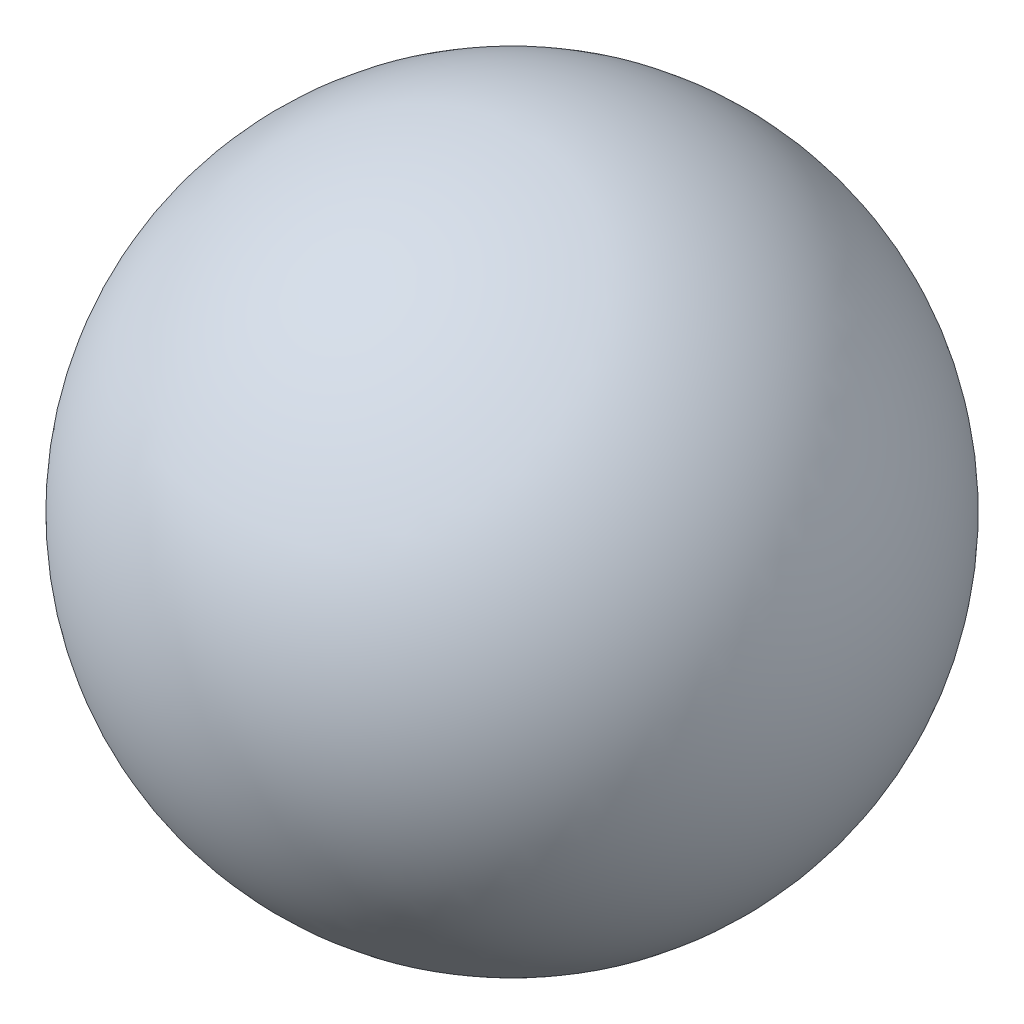
ISO-10303-21;
HEADER;
FILE_DESCRIPTION(('STEP AP214'),'2;1');
FILE_NAME('part.step','',(''),(''),'','','');
FILE_SCHEMA(('AUTOMOTIVE_DESIGN { 1 0 10303 214 1 1 1 1 }'));
ENDSEC;
DATA;
#1=APPLICATION_CONTEXT('core data for automotive mechanical design processes');
#2=APPLICATION_PROTOCOL_DEFINITION('international standard','automotive_design',2000,#1);
#3=PRODUCT_CONTEXT('',#1,'mechanical');
#4=PRODUCT('Part','Part','',(#3));
#5=PRODUCT_RELATED_PRODUCT_CATEGORY('part','',(#4));
#6=PRODUCT_DEFINITION_FORMATION('','',#4);
#7=PRODUCT_DEFINITION_CONTEXT('part definition',#1,'design');
#8=PRODUCT_DEFINITION('design','',#6,#7);
#9=PRODUCT_DEFINITION_SHAPE('','',#8);
#10=(LENGTH_UNIT() NAMED_UNIT(*) SI_UNIT(.MILLI.,.METRE.));
#11=(NAMED_UNIT(*) PLANE_ANGLE_UNIT() SI_UNIT($,.RADIAN.));
#12=(NAMED_UNIT(*) SI_UNIT($,.STERADIAN.) SOLID_ANGLE_UNIT());
#13=UNCERTAINTY_MEASURE_WITH_UNIT(LENGTH_MEASURE(1.E-05),#10,'distance_accuracy_value','');
#14=(GEOMETRIC_REPRESENTATION_CONTEXT(3) GLOBAL_UNCERTAINTY_ASSIGNED_CONTEXT((#13)) GLOBAL_UNIT_ASSIGNED_CONTEXT((#10,
#11,#12)) REPRESENTATION_CONTEXT('',''));
#15=CARTESIAN_POINT('',(0.,0.,0.));
#16=DIRECTION('',(0.,0.,1.));
#17=DIRECTION('',(1.,0.,0.));
#18=AXIS2_PLACEMENT_3D('',#15,#16,#17);
#19=CARTESIAN_POINT('',(0.,0.,0.));
#20=DIRECTION('',(0.,1.,0.));
#21=DIRECTION('',(1.,0.,0.));
#22=AXIS2_PLACEMENT_3D('',#19,#20,#21);
#23=SPHERICAL_SURFACE('',#22,120.65);
#24=CARTESIAN_POINT('',(0.,120.65,0.));
#25=VERTEX_POINT('',#24);
#26=VERTEX_LOOP('',#25);
#27=FACE_BOUND('',#26,.T.);
#28=ADVANCED_FACE('F29',(#27),#23,.T.);
#29=CLOSED_SHELL('',(#28));
#30=MANIFOLD_SOLID_BREP('B2',#29);
#31=ADVANCED_BREP_SHAPE_REPRESENTATION('',(#18,#30),#14);
#32=SHAPE_DEFINITION_REPRESENTATION(#9,#31);
ENDSEC;
END-ISO-10303-21;
